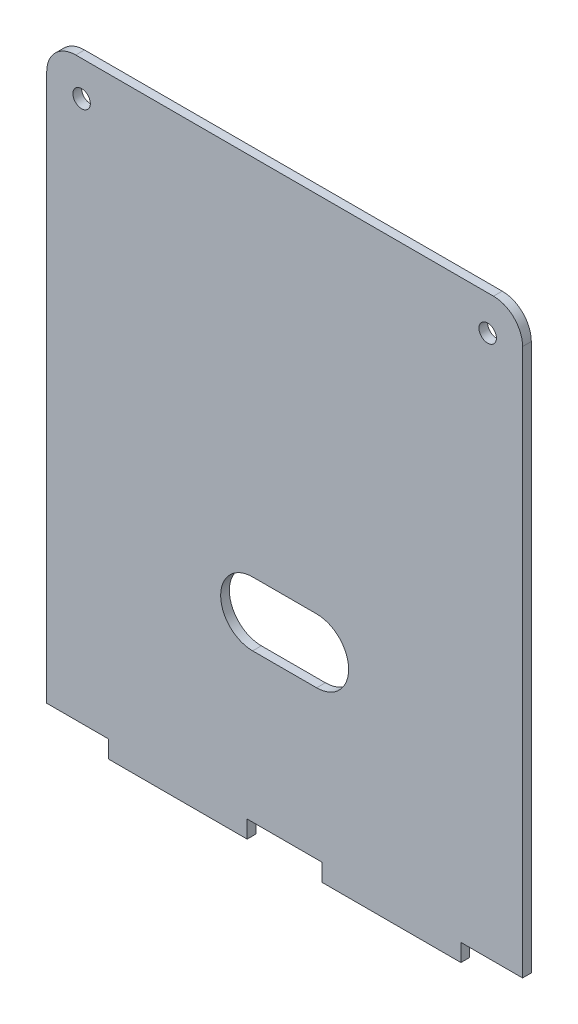
ISO-10303-21;
HEADER;
FILE_DESCRIPTION(('STEP AP214'),'2;1');
FILE_NAME('part.step','',(''),(''),'','','');
FILE_SCHEMA(('AUTOMOTIVE_DESIGN { 1 0 10303 214 1 1 1 1 }'));
ENDSEC;
DATA;
#1=APPLICATION_CONTEXT('core data for automotive mechanical design processes');
#2=APPLICATION_PROTOCOL_DEFINITION('international standard','automotive_design',2000,#1);
#3=PRODUCT_CONTEXT('',#1,'mechanical');
#4=PRODUCT('Part','Part','',(#3));
#5=PRODUCT_RELATED_PRODUCT_CATEGORY('part','',(#4));
#6=PRODUCT_DEFINITION_FORMATION('','',#4);
#7=PRODUCT_DEFINITION_CONTEXT('part definition',#1,'design');
#8=PRODUCT_DEFINITION('design','',#6,#7);
#9=PRODUCT_DEFINITION_SHAPE('','',#8);
#10=(LENGTH_UNIT() NAMED_UNIT(*) SI_UNIT(.MILLI.,.METRE.));
#11=(NAMED_UNIT(*) PLANE_ANGLE_UNIT() SI_UNIT($,.RADIAN.));
#12=(NAMED_UNIT(*) SI_UNIT($,.STERADIAN.) SOLID_ANGLE_UNIT());
#13=UNCERTAINTY_MEASURE_WITH_UNIT(LENGTH_MEASURE(1.E-05),#10,'distance_accuracy_value','');
#14=(GEOMETRIC_REPRESENTATION_CONTEXT(3) GLOBAL_UNCERTAINTY_ASSIGNED_CONTEXT((#13)) GLOBAL_UNIT_ASSIGNED_CONTEXT((#10,
#11,#12)) REPRESENTATION_CONTEXT('',''));
#15=CARTESIAN_POINT('',(0.,0.,0.));
#16=DIRECTION('',(0.,0.,1.));
#17=DIRECTION('',(1.,0.,0.));
#18=AXIS2_PLACEMENT_3D('',#15,#16,#17);
#19=CARTESIAN_POINT('',(0.,0.,1.5));
#20=DIRECTION('',(0.,0.,-1.));
#21=DIRECTION('',(-1.,0.,0.));
#22=AXIS2_PLACEMENT_3D('',#19,#20,#21);
#23=PLANE('',#22);
#24=DIRECTION('',(-1.,0.,0.));
#25=VECTOR('',#24,1.);
#26=CARTESIAN_POINT('',(0.,102.,1.5));
#27=LINE('',#26,#25);
#28=CARTESIAN_POINT('',(76.8,102.,1.5));
#29=VERTEX_POINT('',#28);
#30=CARTESIAN_POINT('',(5.,102.,1.5));
#31=VERTEX_POINT('',#30);
#32=EDGE_CURVE('E285',#29,#31,#27,.T.);
#33=ORIENTED_EDGE('',*,*,#32,.T.);
#34=CARTESIAN_POINT('',(5.,97.,1.5));
#35=DIRECTION('',(0.,0.,-1.));
#36=DIRECTION('',(-1.,0.,0.));
#37=AXIS2_PLACEMENT_3D('',#34,#35,#36);
#38=CIRCLE('',#37,5.);
#39=CARTESIAN_POINT('',(0.,97.,1.5));
#40=VERTEX_POINT('',#39);
#41=EDGE_CURVE('E40',#31,#40,#38,.F.);
#42=ORIENTED_EDGE('',*,*,#41,.T.);
#43=DIRECTION('',(0.,-1.,0.));
#44=VECTOR('',#43,1.);
#45=CARTESIAN_POINT('',(0.,0.,1.5));
#46=LINE('',#45,#44);
#47=CARTESIAN_POINT('',(0.,3.,1.5));
#48=VERTEX_POINT('',#47);
#49=EDGE_CURVE('E276',#40,#48,#46,.T.);
#50=ORIENTED_EDGE('',*,*,#49,.T.);
#51=DIRECTION('',(1.,0.,0.));
#52=VECTOR('',#51,1.);
#53=CARTESIAN_POINT('',(0.,3.,1.5));
#54=LINE('',#53,#52);
#55=CARTESIAN_POINT('',(10.6,3.,1.5));
#56=VERTEX_POINT('',#55);
#57=EDGE_CURVE('E261',#48,#56,#54,.T.);
#58=ORIENTED_EDGE('',*,*,#57,.T.);
#59=DIRECTION('',(0.,1.,0.));
#60=VECTOR('',#59,1.);
#61=CARTESIAN_POINT('',(10.6,0.,1.5));
#62=LINE('',#61,#60);
#63=CARTESIAN_POINT('',(10.6,0.,1.5));
#64=VERTEX_POINT('',#63);
#65=EDGE_CURVE('E251',#64,#56,#62,.T.);
#66=ORIENTED_EDGE('',*,*,#65,.F.);
#67=DIRECTION('',(1.,0.,0.));
#68=VECTOR('',#67,1.);
#69=CARTESIAN_POINT('',(0.,0.,1.5));
#70=LINE('',#69,#68);
#71=CARTESIAN_POINT('',(34.455,0.,1.5));
#72=VERTEX_POINT('',#71);
#73=EDGE_CURVE('E280',#64,#72,#70,.T.);
#74=ORIENTED_EDGE('',*,*,#73,.T.);
#75=DIRECTION('',(0.,1.,0.));
#76=VECTOR('',#75,1.);
#77=CARTESIAN_POINT('',(34.455,0.,1.5));
#78=LINE('',#77,#76);
#79=CARTESIAN_POINT('',(34.455,3.,1.5));
#80=VERTEX_POINT('',#79);
#81=EDGE_CURVE('E241',#72,#80,#78,.T.);
#82=ORIENTED_EDGE('',*,*,#81,.T.);
#83=DIRECTION('',(1.,0.,0.));
#84=VECTOR('',#83,1.);
#85=CARTESIAN_POINT('',(0.,3.,1.5));
#86=LINE('',#85,#84);
#87=CARTESIAN_POINT('',(47.345,3.,1.5));
#88=VERTEX_POINT('',#87);
#89=EDGE_CURVE('E244',#80,#88,#86,.T.);
#90=ORIENTED_EDGE('',*,*,#89,.T.);
#91=DIRECTION('',(0.,1.,0.));
#92=VECTOR('',#91,1.);
#93=CARTESIAN_POINT('',(47.345,0.,1.5));
#94=LINE('',#93,#92);
#95=CARTESIAN_POINT('',(47.345,0.,1.5));
#96=VERTEX_POINT('',#95);
#97=EDGE_CURVE('E248',#96,#88,#94,.T.);
#98=ORIENTED_EDGE('',*,*,#97,.F.);
#99=CARTESIAN_POINT('',(71.2,0.,1.5));
#100=VERTEX_POINT('',#99);
#101=EDGE_CURVE('E278',#96,#100,#70,.T.);
#102=ORIENTED_EDGE('',*,*,#101,.T.);
#103=DIRECTION('',(0.,1.,0.));
#104=VECTOR('',#103,1.);
#105=CARTESIAN_POINT('',(71.2,0.,1.5));
#106=LINE('',#105,#104);
#107=CARTESIAN_POINT('',(71.2,3.,1.5));
#108=VERTEX_POINT('',#107);
#109=EDGE_CURVE('E221',#100,#108,#106,.T.);
#110=ORIENTED_EDGE('',*,*,#109,.T.);
#111=DIRECTION('',(-1.,0.,0.));
#112=VECTOR('',#111,1.);
#113=CARTESIAN_POINT('',(0.,3.,1.5));
#114=LINE('',#113,#112);
#115=CARTESIAN_POINT('',(81.8,3.,1.5));
#116=VERTEX_POINT('',#115);
#117=EDGE_CURVE('E224',#116,#108,#114,.T.);
#118=ORIENTED_EDGE('',*,*,#117,.F.);
#119=DIRECTION('',(0.,1.,0.));
#120=VECTOR('',#119,1.);
#121=CARTESIAN_POINT('',(81.8,0.,1.5));
#122=LINE('',#121,#120);
#123=CARTESIAN_POINT('',(81.8,97.,1.5));
#124=VERTEX_POINT('',#123);
#125=EDGE_CURVE('E283',#116,#124,#122,.T.);
#126=ORIENTED_EDGE('',*,*,#125,.T.);
#127=CARTESIAN_POINT('',(76.8,97.,1.5));
#128=DIRECTION('',(0.,0.,-1.));
#129=DIRECTION('',(-1.,0.,0.));
#130=AXIS2_PLACEMENT_3D('',#127,#128,#129);
#131=CIRCLE('',#130,5.);
#132=EDGE_CURVE('E306',#124,#29,#131,.F.);
#133=ORIENTED_EDGE('',*,*,#132,.T.);
#134=EDGE_LOOP('',(#33,#42,#50,#58,#66,#74,#82,#90,#98,#102,#110,#118,#126,#133));
#135=FACE_BOUND('',#134,.T.);
#136=CARTESIAN_POINT('',(6.,96.,1.5));
#137=DIRECTION('',(0.,0.,1.));
#138=DIRECTION('',(1.,0.,0.));
#139=AXIS2_PLACEMENT_3D('',#136,#137,#138);
#140=CIRCLE('',#139,1.5);
#141=CARTESIAN_POINT('',(7.5,96.,1.5));
#142=VERTEX_POINT('',#141);
#143=EDGE_CURVE('E208',#142,#142,#140,.T.);
#144=ORIENTED_EDGE('',*,*,#143,.F.);
#145=EDGE_LOOP('',(#144));
#146=FACE_BOUND('',#145,.T.);
#147=CARTESIAN_POINT('',(75.8,96.,1.5));
#148=DIRECTION('',(0.,0.,-1.));
#149=DIRECTION('',(-1.,0.,0.));
#150=AXIS2_PLACEMENT_3D('',#147,#148,#149);
#151=CIRCLE('',#150,1.5);
#152=CARTESIAN_POINT('',(74.3,96.,1.5));
#153=VERTEX_POINT('',#152);
#154=EDGE_CURVE('E202',#153,#153,#151,.T.);
#155=ORIENTED_EDGE('',*,*,#154,.T.);
#156=EDGE_LOOP('',(#155));
#157=FACE_BOUND('',#156,.T.);
#158=CARTESIAN_POINT('',(46.4,34.,1.5));
#159=DIRECTION('',(0.,0.,1.));
#160=DIRECTION('',(1.,0.,0.));
#161=AXIS2_PLACEMENT_3D('',#158,#159,#160);
#162=CIRCLE('',#161,5.5);
#163=CARTESIAN_POINT('',(46.4,39.5,1.5));
#164=VERTEX_POINT('',#163);
#165=CARTESIAN_POINT('',(46.4,28.5,1.5));
#166=VERTEX_POINT('',#165);
#167=EDGE_CURVE('E177',#164,#166,#162,.F.);
#168=ORIENTED_EDGE('',*,*,#167,.T.);
#169=DIRECTION('',(1.,0.,0.));
#170=VECTOR('',#169,1.);
#171=CARTESIAN_POINT('',(0.,28.5,1.5));
#172=LINE('',#171,#170);
#173=CARTESIAN_POINT('',(35.4,28.5,1.5));
#174=VERTEX_POINT('',#173);
#175=EDGE_CURVE('E183',#174,#166,#172,.T.);
#176=ORIENTED_EDGE('',*,*,#175,.F.);
#177=CARTESIAN_POINT('',(35.4,34.,1.5));
#178=DIRECTION('',(0.,0.,1.));
#179=DIRECTION('',(1.,0.,0.));
#180=AXIS2_PLACEMENT_3D('',#177,#178,#179);
#181=CIRCLE('',#180,5.5);
#182=CARTESIAN_POINT('',(35.4,39.5,1.5));
#183=VERTEX_POINT('',#182);
#184=EDGE_CURVE('E186',#183,#174,#181,.T.);
#185=ORIENTED_EDGE('',*,*,#184,.F.);
#186=DIRECTION('',(1.,0.,0.));
#187=VECTOR('',#186,1.);
#188=CARTESIAN_POINT('',(0.,39.5,1.5));
#189=LINE('',#188,#187);
#190=EDGE_CURVE('E192',#183,#164,#189,.T.);
#191=ORIENTED_EDGE('',*,*,#190,.T.);
#192=EDGE_LOOP('',(#168,#176,#185,#191));
#193=FACE_BOUND('',#192,.T.);
#194=ADVANCED_FACE('F32',(#135,#146,#157,#193),#23,.F.);
#195=CARTESIAN_POINT('',(0.,0.,0.));
#196=DIRECTION('',(0.,0.,-1.));
#197=DIRECTION('',(-1.,0.,0.));
#198=AXIS2_PLACEMENT_3D('',#195,#196,#197);
#199=PLANE('',#198);
#200=CARTESIAN_POINT('',(75.8,96.,0.));
#201=DIRECTION('',(0.,0.,-1.));
#202=DIRECTION('',(-1.,0.,0.));
#203=AXIS2_PLACEMENT_3D('',#200,#201,#202);
#204=CIRCLE('',#203,1.5);
#205=CARTESIAN_POINT('',(74.3,96.,0.));
#206=VERTEX_POINT('',#205);
#207=EDGE_CURVE('E198',#206,#206,#204,.T.);
#208=ORIENTED_EDGE('',*,*,#207,.F.);
#209=EDGE_LOOP('',(#208));
#210=FACE_BOUND('',#209,.T.);
#211=CARTESIAN_POINT('',(6.,96.,0.));
#212=DIRECTION('',(0.,0.,1.));
#213=DIRECTION('',(1.,0.,0.));
#214=AXIS2_PLACEMENT_3D('',#211,#212,#213);
#215=CIRCLE('',#214,1.5);
#216=CARTESIAN_POINT('',(7.5,96.,0.));
#217=VERTEX_POINT('',#216);
#218=EDGE_CURVE('E205',#217,#217,#215,.T.);
#219=ORIENTED_EDGE('',*,*,#218,.T.);
#220=EDGE_LOOP('',(#219));
#221=FACE_BOUND('',#220,.T.);
#222=DIRECTION('',(0.,-1.,0.));
#223=VECTOR('',#222,1.);
#224=CARTESIAN_POINT('',(0.,0.,0.));
#225=LINE('',#224,#223);
#226=CARTESIAN_POINT('',(0.,97.,0.));
#227=VERTEX_POINT('',#226);
#228=CARTESIAN_POINT('',(0.,3.,0.));
#229=VERTEX_POINT('',#228);
#230=EDGE_CURVE('E272',#227,#229,#225,.T.);
#231=ORIENTED_EDGE('',*,*,#230,.F.);
#232=CARTESIAN_POINT('',(5.,97.,0.));
#233=DIRECTION('',(0.,0.,-1.));
#234=DIRECTION('',(-1.,0.,0.));
#235=AXIS2_PLACEMENT_3D('',#232,#233,#234);
#236=CIRCLE('',#235,5.);
#237=CARTESIAN_POINT('',(5.,102.,0.));
#238=VERTEX_POINT('',#237);
#239=EDGE_CURVE('E300',#227,#238,#236,.T.);
#240=ORIENTED_EDGE('',*,*,#239,.T.);
#241=DIRECTION('',(-1.,0.,0.));
#242=VECTOR('',#241,1.);
#243=CARTESIAN_POINT('',(0.,102.,0.));
#244=LINE('',#243,#242);
#245=CARTESIAN_POINT('',(76.8,102.,0.));
#246=VERTEX_POINT('',#245);
#247=EDGE_CURVE('E279',#246,#238,#244,.T.);
#248=ORIENTED_EDGE('',*,*,#247,.F.);
#249=CARTESIAN_POINT('',(76.8,97.,0.));
#250=DIRECTION('',(0.,0.,-1.));
#251=DIRECTION('',(-1.,0.,0.));
#252=AXIS2_PLACEMENT_3D('',#249,#250,#251);
#253=CIRCLE('',#252,5.);
#254=CARTESIAN_POINT('',(81.8,97.,0.));
#255=VERTEX_POINT('',#254);
#256=EDGE_CURVE('E298',#246,#255,#253,.T.);
#257=ORIENTED_EDGE('',*,*,#256,.T.);
#258=DIRECTION('',(0.,1.,0.));
#259=VECTOR('',#258,1.);
#260=CARTESIAN_POINT('',(81.8,0.,0.));
#261=LINE('',#260,#259);
#262=CARTESIAN_POINT('',(81.8,3.,0.));
#263=VERTEX_POINT('',#262);
#264=EDGE_CURVE('E293',#263,#255,#261,.T.);
#265=ORIENTED_EDGE('',*,*,#264,.F.);
#266=DIRECTION('',(-1.,0.,0.));
#267=VECTOR('',#266,1.);
#268=CARTESIAN_POINT('',(0.,3.,0.));
#269=LINE('',#268,#267);
#270=CARTESIAN_POINT('',(71.2,3.,0.));
#271=VERTEX_POINT('',#270);
#272=EDGE_CURVE('E225',#263,#271,#269,.T.);
#273=ORIENTED_EDGE('',*,*,#272,.T.);
#274=DIRECTION('',(0.,1.,0.));
#275=VECTOR('',#274,1.);
#276=CARTESIAN_POINT('',(71.2,0.,0.));
#277=LINE('',#276,#275);
#278=CARTESIAN_POINT('',(71.2,0.,0.));
#279=VERTEX_POINT('',#278);
#280=EDGE_CURVE('E216',#279,#271,#277,.T.);
#281=ORIENTED_EDGE('',*,*,#280,.F.);
#282=DIRECTION('',(1.,0.,0.));
#283=VECTOR('',#282,1.);
#284=CARTESIAN_POINT('',(0.,0.,0.));
#285=LINE('',#284,#283);
#286=CARTESIAN_POINT('',(47.345,0.,0.));
#287=VERTEX_POINT('',#286);
#288=EDGE_CURVE('E289',#287,#279,#285,.T.);
#289=ORIENTED_EDGE('',*,*,#288,.F.);
#290=DIRECTION('',(0.,1.,0.));
#291=VECTOR('',#290,1.);
#292=CARTESIAN_POINT('',(47.345,0.,0.));
#293=LINE('',#292,#291);
#294=CARTESIAN_POINT('',(47.345,3.,0.));
#295=VERTEX_POINT('',#294);
#296=EDGE_CURVE('E245',#287,#295,#293,.T.);
#297=ORIENTED_EDGE('',*,*,#296,.T.);
#298=DIRECTION('',(1.,0.,0.));
#299=VECTOR('',#298,1.);
#300=CARTESIAN_POINT('',(0.,3.,0.));
#301=LINE('',#300,#299);
#302=CARTESIAN_POINT('',(34.455,3.,0.));
#303=VERTEX_POINT('',#302);
#304=EDGE_CURVE('E253',#303,#295,#301,.T.);
#305=ORIENTED_EDGE('',*,*,#304,.F.);
#306=DIRECTION('',(0.,1.,0.));
#307=VECTOR('',#306,1.);
#308=CARTESIAN_POINT('',(34.455,0.,0.));
#309=LINE('',#308,#307);
#310=CARTESIAN_POINT('',(34.455,0.,0.));
#311=VERTEX_POINT('',#310);
#312=EDGE_CURVE('E234',#311,#303,#309,.T.);
#313=ORIENTED_EDGE('',*,*,#312,.F.);
#314=CARTESIAN_POINT('',(10.6,0.,0.));
#315=VERTEX_POINT('',#314);
#316=EDGE_CURVE('E290',#315,#311,#285,.T.);
#317=ORIENTED_EDGE('',*,*,#316,.F.);
#318=DIRECTION('',(0.,1.,0.));
#319=VECTOR('',#318,1.);
#320=CARTESIAN_POINT('',(10.6,0.,0.));
#321=LINE('',#320,#319);
#322=CARTESIAN_POINT('',(10.6,3.,0.));
#323=VERTEX_POINT('',#322);
#324=EDGE_CURVE('E257',#315,#323,#321,.T.);
#325=ORIENTED_EDGE('',*,*,#324,.T.);
#326=DIRECTION('',(1.,0.,0.));
#327=VECTOR('',#326,1.);
#328=CARTESIAN_POINT('',(0.,3.,0.));
#329=LINE('',#328,#327);
#330=EDGE_CURVE('E260',#229,#323,#329,.T.);
#331=ORIENTED_EDGE('',*,*,#330,.F.);
#332=EDGE_LOOP('',(#231,#240,#248,#257,#265,#273,#281,#289,#297,#305,#313,#317,#325,#331));
#333=FACE_BOUND('',#332,.T.);
#334=DIRECTION('',(1.,0.,0.));
#335=VECTOR('',#334,1.);
#336=CARTESIAN_POINT('',(0.,28.5,0.));
#337=LINE('',#336,#335);
#338=CARTESIAN_POINT('',(35.4,28.5,0.));
#339=VERTEX_POINT('',#338);
#340=CARTESIAN_POINT('',(46.4,28.5,0.));
#341=VERTEX_POINT('',#340);
#342=EDGE_CURVE('E178',#339,#341,#337,.T.);
#343=ORIENTED_EDGE('',*,*,#342,.T.);
#344=CARTESIAN_POINT('',(46.4,34.,0.));
#345=DIRECTION('',(0.,0.,1.));
#346=DIRECTION('',(1.,0.,0.));
#347=AXIS2_PLACEMENT_3D('',#344,#345,#346);
#348=CIRCLE('',#347,5.5);
#349=CARTESIAN_POINT('',(46.4,39.5,0.));
#350=VERTEX_POINT('',#349);
#351=EDGE_CURVE('E171',#350,#341,#348,.F.);
#352=ORIENTED_EDGE('',*,*,#351,.F.);
#353=DIRECTION('',(1.,0.,0.));
#354=VECTOR('',#353,1.);
#355=CARTESIAN_POINT('',(0.,39.5,0.));
#356=LINE('',#355,#354);
#357=CARTESIAN_POINT('',(35.4,39.5,0.));
#358=VERTEX_POINT('',#357);
#359=EDGE_CURVE('E160',#358,#350,#356,.T.);
#360=ORIENTED_EDGE('',*,*,#359,.F.);
#361=CARTESIAN_POINT('',(35.4,34.,0.));
#362=DIRECTION('',(0.,0.,1.));
#363=DIRECTION('',(1.,0.,0.));
#364=AXIS2_PLACEMENT_3D('',#361,#362,#363);
#365=CIRCLE('',#364,5.5);
#366=EDGE_CURVE('E170',#358,#339,#365,.T.);
#367=ORIENTED_EDGE('',*,*,#366,.T.);
#368=EDGE_LOOP('',(#343,#352,#360,#367));
#369=FACE_BOUND('',#368,.T.);
#370=ADVANCED_FACE('F181',(#210,#221,#333,#369),#199,.T.);
#371=CARTESIAN_POINT('',(0.,0.,1.5));
#372=DIRECTION('',(0.,1.,0.));
#373=DIRECTION('',(0.,0.,1.));
#374=AXIS2_PLACEMENT_3D('',#371,#372,#373);
#375=PLANE('',#374);
#376=DIRECTION('',(0.,0.,1.));
#377=VECTOR('',#376,1.);
#378=CARTESIAN_POINT('',(71.2,0.,0.));
#379=LINE('',#378,#377);
#380=EDGE_CURVE('E211',#279,#100,#379,.T.);
#381=ORIENTED_EDGE('',*,*,#380,.T.);
#382=ORIENTED_EDGE('',*,*,#101,.F.);
#383=DIRECTION('',(0.,0.,1.));
#384=VECTOR('',#383,1.);
#385=CARTESIAN_POINT('',(47.345,0.,0.));
#386=LINE('',#385,#384);
#387=EDGE_CURVE('E232',#287,#96,#386,.T.);
#388=ORIENTED_EDGE('',*,*,#387,.F.);
#389=ORIENTED_EDGE('',*,*,#288,.T.);
#390=EDGE_LOOP('',(#381,#382,#388,#389));
#391=FACE_BOUND('',#390,.T.);
#392=ADVANCED_FACE('F341',(#391),#375,.F.);
#393=DIRECTION('',(0.,0.,1.));
#394=VECTOR('',#393,1.);
#395=CARTESIAN_POINT('',(34.455,0.,0.));
#396=LINE('',#395,#394);
#397=EDGE_CURVE('E228',#311,#72,#396,.T.);
#398=ORIENTED_EDGE('',*,*,#397,.T.);
#399=ORIENTED_EDGE('',*,*,#73,.F.);
#400=DIRECTION('',(0.,0.,1.));
#401=VECTOR('',#400,1.);
#402=CARTESIAN_POINT('',(10.6,0.,0.));
#403=LINE('',#402,#401);
#404=EDGE_CURVE('E264',#315,#64,#403,.T.);
#405=ORIENTED_EDGE('',*,*,#404,.F.);
#406=ORIENTED_EDGE('',*,*,#316,.T.);
#407=EDGE_LOOP('',(#398,#399,#405,#406));
#408=FACE_BOUND('',#407,.T.);
#409=ADVANCED_FACE('F358',(#408),#375,.F.);
#410=CARTESIAN_POINT('',(0.,0.,1.5));
#411=DIRECTION('',(1.,0.,0.));
#412=DIRECTION('',(0.,0.,-1.));
#413=AXIS2_PLACEMENT_3D('',#410,#411,#412);
#414=PLANE('',#413);
#415=ORIENTED_EDGE('',*,*,#49,.F.);
#416=DIRECTION('',(0.,0.,-1.));
#417=VECTOR('',#416,1.);
#418=CARTESIAN_POINT('',(0.,97.,1.5));
#419=LINE('',#418,#417);
#420=EDGE_CURVE('E287',#40,#227,#419,.T.);
#421=ORIENTED_EDGE('',*,*,#420,.T.);
#422=ORIENTED_EDGE('',*,*,#230,.T.);
#423=DIRECTION('',(0.,0.,1.));
#424=VECTOR('',#423,1.);
#425=CARTESIAN_POINT('',(0.,3.,0.));
#426=LINE('',#425,#424);
#427=EDGE_CURVE('E269',#229,#48,#426,.T.);
#428=ORIENTED_EDGE('',*,*,#427,.T.);
#429=EDGE_LOOP('',(#415,#421,#422,#428));
#430=FACE_BOUND('',#429,.T.);
#431=ADVANCED_FACE('F315',(#430),#414,.F.);
#432=CARTESIAN_POINT('',(81.8,0.,1.5));
#433=DIRECTION('',(-1.,0.,0.));
#434=DIRECTION('',(0.,0.,1.));
#435=AXIS2_PLACEMENT_3D('',#432,#433,#434);
#436=PLANE('',#435);
#437=ORIENTED_EDGE('',*,*,#264,.T.);
#438=DIRECTION('',(0.,0.,-1.));
#439=VECTOR('',#438,1.);
#440=CARTESIAN_POINT('',(81.8,97.,1.5));
#441=LINE('',#440,#439);
#442=EDGE_CURVE('E11',#255,#124,#441,.F.);
#443=ORIENTED_EDGE('',*,*,#442,.T.);
#444=ORIENTED_EDGE('',*,*,#125,.F.);
#445=DIRECTION('',(0.,0.,1.));
#446=VECTOR('',#445,1.);
#447=CARTESIAN_POINT('',(81.8,3.,0.));
#448=LINE('',#447,#446);
#449=EDGE_CURVE('E214',#263,#116,#448,.T.);
#450=ORIENTED_EDGE('',*,*,#449,.F.);
#451=EDGE_LOOP('',(#437,#443,#444,#450));
#452=FACE_BOUND('',#451,.T.);
#453=ADVANCED_FACE('F328',(#452),#436,.F.);
#454=CARTESIAN_POINT('',(0.,102.,1.5));
#455=DIRECTION('',(0.,-1.,0.));
#456=DIRECTION('',(0.,0.,-1.));
#457=AXIS2_PLACEMENT_3D('',#454,#455,#456);
#458=PLANE('',#457);
#459=ORIENTED_EDGE('',*,*,#247,.T.);
#460=DIRECTION('',(0.,0.,-1.));
#461=VECTOR('',#460,1.);
#462=CARTESIAN_POINT('',(5.,102.,1.5));
#463=LINE('',#462,#461);
#464=EDGE_CURVE('E53',#238,#31,#463,.F.);
#465=ORIENTED_EDGE('',*,*,#464,.T.);
#466=ORIENTED_EDGE('',*,*,#32,.F.);
#467=DIRECTION('',(0.,0.,-1.));
#468=VECTOR('',#467,1.);
#469=CARTESIAN_POINT('',(76.8,102.,1.5));
#470=LINE('',#469,#468);
#471=EDGE_CURVE('E302',#29,#246,#470,.T.);
#472=ORIENTED_EDGE('',*,*,#471,.T.);
#473=EDGE_LOOP('',(#459,#465,#466,#472));
#474=FACE_BOUND('',#473,.T.);
#475=ADVANCED_FACE('F322',(#474),#458,.F.);
#476=CARTESIAN_POINT('',(0.,3.,0.));
#477=DIRECTION('',(0.,-1.,0.));
#478=DIRECTION('',(0.,0.,-1.));
#479=AXIS2_PLACEMENT_3D('',#476,#477,#478);
#480=PLANE('',#479);
#481=ORIENTED_EDGE('',*,*,#57,.F.);
#482=ORIENTED_EDGE('',*,*,#427,.F.);
#483=ORIENTED_EDGE('',*,*,#330,.T.);
#484=DIRECTION('',(0.,0.,1.));
#485=VECTOR('',#484,1.);
#486=CARTESIAN_POINT('',(10.6,3.,0.));
#487=LINE('',#486,#485);
#488=EDGE_CURVE('E273',#323,#56,#487,.T.);
#489=ORIENTED_EDGE('',*,*,#488,.T.);
#490=EDGE_LOOP('',(#481,#482,#483,#489));
#491=FACE_BOUND('',#490,.T.);
#492=ADVANCED_FACE('F364',(#491),#480,.T.);
#493=CARTESIAN_POINT('',(10.6,0.,0.));
#494=DIRECTION('',(1.,0.,0.));
#495=DIRECTION('',(0.,0.,-1.));
#496=AXIS2_PLACEMENT_3D('',#493,#494,#495);
#497=PLANE('',#496);
#498=ORIENTED_EDGE('',*,*,#65,.T.);
#499=ORIENTED_EDGE('',*,*,#488,.F.);
#500=ORIENTED_EDGE('',*,*,#324,.F.);
#501=ORIENTED_EDGE('',*,*,#404,.T.);
#502=EDGE_LOOP('',(#498,#499,#500,#501));
#503=FACE_BOUND('',#502,.T.);
#504=ADVANCED_FACE('F362',(#503),#497,.F.);
#505=CARTESIAN_POINT('',(34.455,0.,0.));
#506=DIRECTION('',(1.,0.,0.));
#507=DIRECTION('',(0.,0.,-1.));
#508=AXIS2_PLACEMENT_3D('',#505,#506,#507);
#509=PLANE('',#508);
#510=ORIENTED_EDGE('',*,*,#81,.F.);
#511=ORIENTED_EDGE('',*,*,#397,.F.);
#512=ORIENTED_EDGE('',*,*,#312,.T.);
#513=DIRECTION('',(0.,0.,1.));
#514=VECTOR('',#513,1.);
#515=CARTESIAN_POINT('',(34.455,3.,0.));
#516=LINE('',#515,#514);
#517=EDGE_CURVE('E237',#303,#80,#516,.T.);
#518=ORIENTED_EDGE('',*,*,#517,.T.);
#519=EDGE_LOOP('',(#510,#511,#512,#518));
#520=FACE_BOUND('',#519,.T.);
#521=ADVANCED_FACE('F354',(#520),#509,.T.);
#522=CARTESIAN_POINT('',(0.,3.,0.));
#523=DIRECTION('',(0.,-1.,0.));
#524=DIRECTION('',(0.,0.,-1.));
#525=AXIS2_PLACEMENT_3D('',#522,#523,#524);
#526=PLANE('',#525);
#527=ORIENTED_EDGE('',*,*,#89,.F.);
#528=ORIENTED_EDGE('',*,*,#517,.F.);
#529=ORIENTED_EDGE('',*,*,#304,.T.);
#530=DIRECTION('',(0.,0.,1.));
#531=VECTOR('',#530,1.);
#532=CARTESIAN_POINT('',(47.345,3.,0.));
#533=LINE('',#532,#531);
#534=EDGE_CURVE('E235',#295,#88,#533,.T.);
#535=ORIENTED_EDGE('',*,*,#534,.T.);
#536=EDGE_LOOP('',(#527,#528,#529,#535));
#537=FACE_BOUND('',#536,.T.);
#538=ADVANCED_FACE('F351',(#537),#526,.T.);
#539=CARTESIAN_POINT('',(47.345,0.,0.));
#540=DIRECTION('',(1.,0.,0.));
#541=DIRECTION('',(0.,0.,-1.));
#542=AXIS2_PLACEMENT_3D('',#539,#540,#541);
#543=PLANE('',#542);
#544=ORIENTED_EDGE('',*,*,#97,.T.);
#545=ORIENTED_EDGE('',*,*,#534,.F.);
#546=ORIENTED_EDGE('',*,*,#296,.F.);
#547=ORIENTED_EDGE('',*,*,#387,.T.);
#548=EDGE_LOOP('',(#544,#545,#546,#547));
#549=FACE_BOUND('',#548,.T.);
#550=ADVANCED_FACE('F348',(#549),#543,.F.);
#551=CARTESIAN_POINT('',(71.2,0.,0.));
#552=DIRECTION('',(1.,0.,0.));
#553=DIRECTION('',(0.,0.,-1.));
#554=AXIS2_PLACEMENT_3D('',#551,#552,#553);
#555=PLANE('',#554);
#556=ORIENTED_EDGE('',*,*,#109,.F.);
#557=ORIENTED_EDGE('',*,*,#380,.F.);
#558=ORIENTED_EDGE('',*,*,#280,.T.);
#559=DIRECTION('',(0.,0.,1.));
#560=VECTOR('',#559,1.);
#561=CARTESIAN_POINT('',(71.2,3.,0.));
#562=LINE('',#561,#560);
#563=EDGE_CURVE('E217',#271,#108,#562,.T.);
#564=ORIENTED_EDGE('',*,*,#563,.T.);
#565=EDGE_LOOP('',(#556,#557,#558,#564));
#566=FACE_BOUND('',#565,.T.);
#567=ADVANCED_FACE('F337',(#566),#555,.T.);
#568=CARTESIAN_POINT('',(0.,3.,0.));
#569=DIRECTION('',(0.,1.,0.));
#570=DIRECTION('',(0.,0.,1.));
#571=AXIS2_PLACEMENT_3D('',#568,#569,#570);
#572=PLANE('',#571);
#573=ORIENTED_EDGE('',*,*,#117,.T.);
#574=ORIENTED_EDGE('',*,*,#563,.F.);
#575=ORIENTED_EDGE('',*,*,#272,.F.);
#576=ORIENTED_EDGE('',*,*,#449,.T.);
#577=EDGE_LOOP('',(#573,#574,#575,#576));
#578=FACE_BOUND('',#577,.T.);
#579=ADVANCED_FACE('F331',(#578),#572,.F.);
#580=CARTESIAN_POINT('',(6.,96.,0.));
#581=DIRECTION('',(0.,0.,1.));
#582=DIRECTION('',(1.,0.,0.));
#583=AXIS2_PLACEMENT_3D('',#580,#581,#582);
#584=CYLINDRICAL_SURFACE('',#583,1.5);
#585=ORIENTED_EDGE('',*,*,#218,.F.);
#586=EDGE_LOOP('',(#585));
#587=FACE_BOUND('',#586,.T.);
#588=ORIENTED_EDGE('',*,*,#143,.T.);
#589=EDGE_LOOP('',(#588));
#590=FACE_BOUND('',#589,.T.);
#591=ADVANCED_FACE('F407',(#587,#590),#584,.F.);
#592=CARTESIAN_POINT('',(75.8,96.,0.));
#593=DIRECTION('',(0.,0.,1.));
#594=DIRECTION('',(1.,0.,0.));
#595=AXIS2_PLACEMENT_3D('',#592,#593,#594);
#596=CYLINDRICAL_SURFACE('',#595,1.5);
#597=ORIENTED_EDGE('',*,*,#207,.T.);
#598=EDGE_LOOP('',(#597));
#599=FACE_BOUND('',#598,.T.);
#600=ORIENTED_EDGE('',*,*,#154,.F.);
#601=EDGE_LOOP('',(#600));
#602=FACE_BOUND('',#601,.T.);
#603=ADVANCED_FACE('F404',(#599,#602),#596,.F.);
#604=CARTESIAN_POINT('',(46.4,34.,0.));
#605=DIRECTION('',(0.,0.,1.));
#606=DIRECTION('',(1.,0.,0.));
#607=AXIS2_PLACEMENT_3D('',#604,#605,#606);
#608=CYLINDRICAL_SURFACE('',#607,5.5);
#609=ORIENTED_EDGE('',*,*,#167,.F.);
#610=DIRECTION('',(0.,0.,1.));
#611=VECTOR('',#610,1.);
#612=CARTESIAN_POINT('',(46.4,39.5,0.));
#613=LINE('',#612,#611);
#614=EDGE_CURVE('E164',#350,#164,#613,.T.);
#615=ORIENTED_EDGE('',*,*,#614,.F.);
#616=ORIENTED_EDGE('',*,*,#351,.T.);
#617=DIRECTION('',(0.,0.,1.));
#618=VECTOR('',#617,1.);
#619=CARTESIAN_POINT('',(46.4,28.5,0.));
#620=LINE('',#619,#618);
#621=EDGE_CURVE('E196',#341,#166,#620,.T.);
#622=ORIENTED_EDGE('',*,*,#621,.T.);
#623=EDGE_LOOP('',(#609,#615,#616,#622));
#624=FACE_BOUND('',#623,.T.);
#625=ADVANCED_FACE('F174',(#624),#608,.F.);
#626=CARTESIAN_POINT('',(0.,28.5,0.));
#627=DIRECTION('',(0.,-1.,0.));
#628=DIRECTION('',(0.,0.,-1.));
#629=AXIS2_PLACEMENT_3D('',#626,#627,#628);
#630=PLANE('',#629);
#631=ORIENTED_EDGE('',*,*,#175,.T.);
#632=ORIENTED_EDGE('',*,*,#621,.F.);
#633=ORIENTED_EDGE('',*,*,#342,.F.);
#634=DIRECTION('',(0.,0.,1.));
#635=VECTOR('',#634,1.);
#636=CARTESIAN_POINT('',(35.4,28.5,0.));
#637=LINE('',#636,#635);
#638=EDGE_CURVE('E199',#339,#174,#637,.T.);
#639=ORIENTED_EDGE('',*,*,#638,.T.);
#640=EDGE_LOOP('',(#631,#632,#633,#639));
#641=FACE_BOUND('',#640,.T.);
#642=ADVANCED_FACE('F397',(#641),#630,.F.);
#643=CARTESIAN_POINT('',(35.4,34.,0.));
#644=DIRECTION('',(0.,0.,1.));
#645=DIRECTION('',(1.,0.,0.));
#646=AXIS2_PLACEMENT_3D('',#643,#644,#645);
#647=CYLINDRICAL_SURFACE('',#646,5.5);
#648=ORIENTED_EDGE('',*,*,#184,.T.);
#649=ORIENTED_EDGE('',*,*,#638,.F.);
#650=ORIENTED_EDGE('',*,*,#366,.F.);
#651=DIRECTION('',(0.,0.,1.));
#652=VECTOR('',#651,1.);
#653=CARTESIAN_POINT('',(35.4,39.5,0.));
#654=LINE('',#653,#652);
#655=EDGE_CURVE('E166',#358,#183,#654,.T.);
#656=ORIENTED_EDGE('',*,*,#655,.T.);
#657=EDGE_LOOP('',(#648,#649,#650,#656));
#658=FACE_BOUND('',#657,.T.);
#659=ADVANCED_FACE('F392',(#658),#647,.F.);
#660=CARTESIAN_POINT('',(0.,39.5,0.));
#661=DIRECTION('',(0.,-1.,0.));
#662=DIRECTION('',(0.,0.,-1.));
#663=AXIS2_PLACEMENT_3D('',#660,#661,#662);
#664=PLANE('',#663);
#665=ORIENTED_EDGE('',*,*,#190,.F.);
#666=ORIENTED_EDGE('',*,*,#655,.F.);
#667=ORIENTED_EDGE('',*,*,#359,.T.);
#668=ORIENTED_EDGE('',*,*,#614,.T.);
#669=EDGE_LOOP('',(#665,#666,#667,#668));
#670=FACE_BOUND('',#669,.T.);
#671=ADVANCED_FACE('F163',(#670),#664,.T.);
#672=CARTESIAN_POINT('',(5.,97.,1.5));
#673=DIRECTION('',(0.,0.,-1.));
#674=DIRECTION('',(-1.,0.,0.));
#675=AXIS2_PLACEMENT_3D('',#672,#673,#674);
#676=CYLINDRICAL_SURFACE('',#675,5.);
#677=ORIENTED_EDGE('',*,*,#41,.F.);
#678=ORIENTED_EDGE('',*,*,#464,.F.);
#679=ORIENTED_EDGE('',*,*,#239,.F.);
#680=ORIENTED_EDGE('',*,*,#420,.F.);
#681=EDGE_LOOP('',(#677,#678,#679,#680));
#682=FACE_BOUND('',#681,.T.);
#683=ADVANCED_FACE('F318',(#682),#676,.T.);
#684=CARTESIAN_POINT('',(76.8,97.,1.5));
#685=DIRECTION('',(0.,0.,-1.));
#686=DIRECTION('',(-1.,0.,0.));
#687=AXIS2_PLACEMENT_3D('',#684,#685,#686);
#688=CYLINDRICAL_SURFACE('',#687,5.);
#689=ORIENTED_EDGE('',*,*,#132,.F.);
#690=ORIENTED_EDGE('',*,*,#442,.F.);
#691=ORIENTED_EDGE('',*,*,#256,.F.);
#692=ORIENTED_EDGE('',*,*,#471,.F.);
#693=EDGE_LOOP('',(#689,#690,#691,#692));
#694=FACE_BOUND('',#693,.T.);
#695=ADVANCED_FACE('F34',(#694),#688,.T.);
#696=CLOSED_SHELL('',(#194,#370,#392,#409,#431,#453,#475,#492,#504,#521,#538,#550,#567,#579,
#591,#603,#625,#642,#659,#671,#683,#695));
#697=MANIFOLD_SOLID_BREP('B2',#696);
#698=ADVANCED_BREP_SHAPE_REPRESENTATION('',(#18,#697),#14);
#699=SHAPE_DEFINITION_REPRESENTATION(#9,#698);
ENDSEC;
END-ISO-10303-21;
